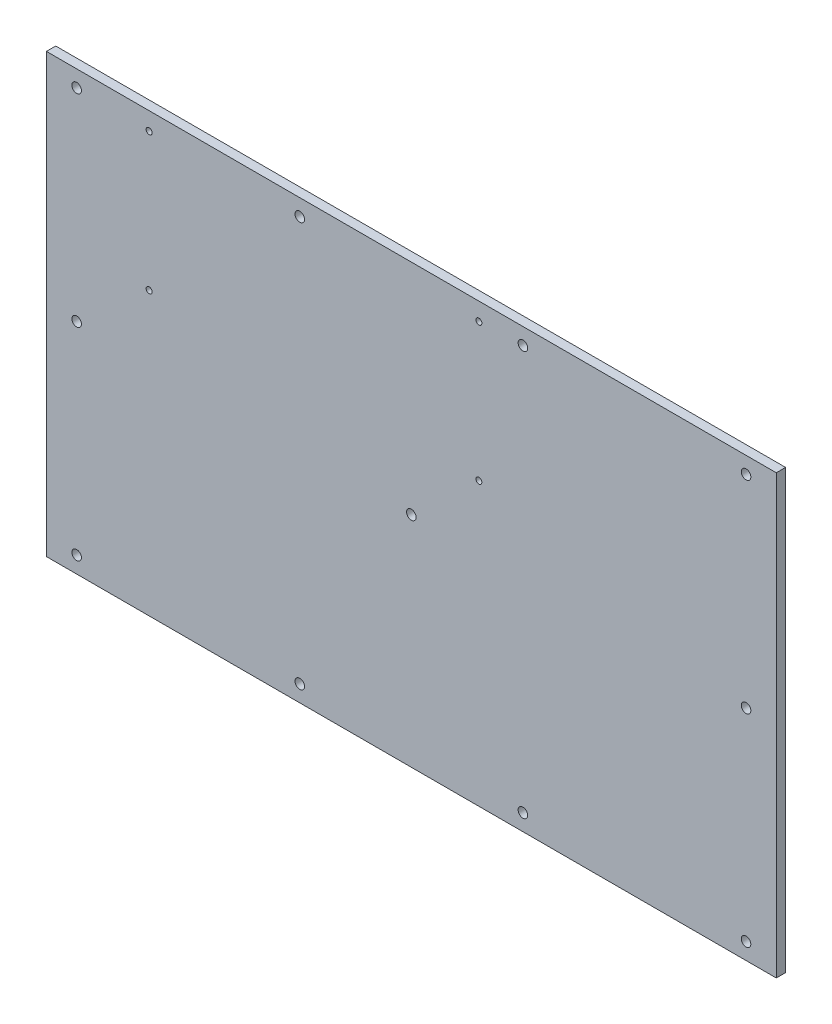
ISO-10303-21;
HEADER;
FILE_DESCRIPTION(('STEP AP214'),'2;1');
FILE_NAME('part.step','',(''),(''),'','','');
FILE_SCHEMA(('AUTOMOTIVE_DESIGN { 1 0 10303 214 1 1 1 1 }'));
ENDSEC;
DATA;
#1=APPLICATION_CONTEXT('core data for automotive mechanical design processes');
#2=APPLICATION_PROTOCOL_DEFINITION('international standard','automotive_design',2000,#1);
#3=PRODUCT_CONTEXT('',#1,'mechanical');
#4=PRODUCT('Part','Part','',(#3));
#5=PRODUCT_RELATED_PRODUCT_CATEGORY('part','',(#4));
#6=PRODUCT_DEFINITION_FORMATION('','',#4);
#7=PRODUCT_DEFINITION_CONTEXT('part definition',#1,'design');
#8=PRODUCT_DEFINITION('design','',#6,#7);
#9=PRODUCT_DEFINITION_SHAPE('','',#8);
#10=(LENGTH_UNIT() NAMED_UNIT(*) SI_UNIT(.MILLI.,.METRE.));
#11=(NAMED_UNIT(*) PLANE_ANGLE_UNIT() SI_UNIT($,.RADIAN.));
#12=(NAMED_UNIT(*) SI_UNIT($,.STERADIAN.) SOLID_ANGLE_UNIT());
#13=UNCERTAINTY_MEASURE_WITH_UNIT(LENGTH_MEASURE(1.E-05),#10,'distance_accuracy_value','');
#14=(GEOMETRIC_REPRESENTATION_CONTEXT(3) GLOBAL_UNCERTAINTY_ASSIGNED_CONTEXT((#13)) GLOBAL_UNIT_ASSIGNED_CONTEXT((#10,
#11,#12)) REPRESENTATION_CONTEXT('',''));
#15=CARTESIAN_POINT('',(0.,0.,0.));
#16=DIRECTION('',(0.,0.,1.));
#17=DIRECTION('',(1.,0.,0.));
#18=AXIS2_PLACEMENT_3D('',#15,#16,#17);
#19=CARTESIAN_POINT('',(-124.46,74.6125,3.175));
#20=DIRECTION('',(1.,0.,0.));
#21=DIRECTION('',(0.,1.,0.));
#22=AXIS2_PLACEMENT_3D('',#19,#20,#21);
#23=PLANE('',#22);
#24=DIRECTION('',(0.,-1.,0.));
#25=VECTOR('',#24,1.);
#26=CARTESIAN_POINT('',(-124.46,74.6125,0.));
#27=LINE('',#26,#25);
#28=CARTESIAN_POINT('',(-124.46,74.6125,0.));
#29=VERTEX_POINT('',#28);
#30=CARTESIAN_POINT('',(-124.46,-74.6125,0.));
#31=VERTEX_POINT('',#30);
#32=EDGE_CURVE('E97',#29,#31,#27,.T.);
#33=ORIENTED_EDGE('',*,*,#32,.T.);
#34=DIRECTION('',(0.,0.,-1.));
#35=VECTOR('',#34,1.);
#36=CARTESIAN_POINT('',(-124.46,-74.6125,3.175));
#37=LINE('',#36,#35);
#38=CARTESIAN_POINT('',(-124.46,-74.6125,3.175));
#39=VERTEX_POINT('',#38);
#40=EDGE_CURVE('E11',#39,#31,#37,.T.);
#41=ORIENTED_EDGE('',*,*,#40,.F.);
#42=DIRECTION('',(0.,-1.,0.));
#43=VECTOR('',#42,1.);
#44=CARTESIAN_POINT('',(-124.46,74.6125,3.175));
#45=LINE('',#44,#43);
#46=CARTESIAN_POINT('',(-124.46,74.6125,3.175));
#47=VERTEX_POINT('',#46);
#48=EDGE_CURVE('E83',#47,#39,#45,.T.);
#49=ORIENTED_EDGE('',*,*,#48,.F.);
#50=DIRECTION('',(0.,0.,-1.));
#51=VECTOR('',#50,1.);
#52=CARTESIAN_POINT('',(-124.46,74.6125,3.175));
#53=LINE('',#52,#51);
#54=EDGE_CURVE('E50',#47,#29,#53,.T.);
#55=ORIENTED_EDGE('',*,*,#54,.T.);
#56=EDGE_LOOP('',(#33,#41,#49,#55));
#57=FACE_BOUND('',#56,.T.);
#58=ADVANCED_FACE('F34',(#57),#23,.F.);
#59=CARTESIAN_POINT('',(-124.46,-74.6125,3.175));
#60=DIRECTION('',(0.,1.,0.));
#61=DIRECTION('',(0.,0.,1.));
#62=AXIS2_PLACEMENT_3D('',#59,#60,#61);
#63=PLANE('',#62);
#64=DIRECTION('',(1.,0.,0.));
#65=VECTOR('',#64,1.);
#66=CARTESIAN_POINT('',(-124.46,-74.6125,0.));
#67=LINE('',#66,#65);
#68=CARTESIAN_POINT('',(124.46,-74.6125,0.));
#69=VERTEX_POINT('',#68);
#70=EDGE_CURVE('E88',#31,#69,#67,.T.);
#71=ORIENTED_EDGE('',*,*,#70,.T.);
#72=DIRECTION('',(0.,0.,-1.));
#73=VECTOR('',#72,1.);
#74=CARTESIAN_POINT('',(124.46,-74.6125,3.175));
#75=LINE('',#74,#73);
#76=CARTESIAN_POINT('',(124.46,-74.6125,3.175));
#77=VERTEX_POINT('',#76);
#78=EDGE_CURVE('E42',#77,#69,#75,.T.);
#79=ORIENTED_EDGE('',*,*,#78,.F.);
#80=DIRECTION('',(1.,0.,0.));
#81=VECTOR('',#80,1.);
#82=CARTESIAN_POINT('',(-124.46,-74.6125,3.175));
#83=LINE('',#82,#81);
#84=EDGE_CURVE('E75',#39,#77,#83,.T.);
#85=ORIENTED_EDGE('',*,*,#84,.F.);
#86=ORIENTED_EDGE('',*,*,#40,.T.);
#87=EDGE_LOOP('',(#71,#79,#85,#86));
#88=FACE_BOUND('',#87,.T.);
#89=ADVANCED_FACE('F87',(#88),#63,.F.);
#90=CARTESIAN_POINT('',(124.46,74.6125,3.175));
#91=DIRECTION('',(1.,0.,0.));
#92=DIRECTION('',(0.,1.,0.));
#93=AXIS2_PLACEMENT_3D('',#90,#91,#92);
#94=PLANE('',#93);
#95=DIRECTION('',(0.,-1.,0.));
#96=VECTOR('',#95,1.);
#97=CARTESIAN_POINT('',(124.46,74.6125,0.));
#98=LINE('',#97,#96);
#99=CARTESIAN_POINT('',(124.46,74.6125,0.));
#100=VERTEX_POINT('',#99);
#101=EDGE_CURVE('E101',#100,#69,#98,.T.);
#102=ORIENTED_EDGE('',*,*,#101,.F.);
#103=DIRECTION('',(0.,0.,-1.));
#104=VECTOR('',#103,1.);
#105=CARTESIAN_POINT('',(124.46,74.6125,3.175));
#106=LINE('',#105,#104);
#107=CARTESIAN_POINT('',(124.46,74.6125,3.175));
#108=VERTEX_POINT('',#107);
#109=EDGE_CURVE('E64',#108,#100,#106,.T.);
#110=ORIENTED_EDGE('',*,*,#109,.F.);
#111=DIRECTION('',(0.,-1.,0.));
#112=VECTOR('',#111,1.);
#113=CARTESIAN_POINT('',(124.46,74.6125,3.175));
#114=LINE('',#113,#112);
#115=EDGE_CURVE('E82',#108,#77,#114,.T.);
#116=ORIENTED_EDGE('',*,*,#115,.T.);
#117=ORIENTED_EDGE('',*,*,#78,.T.);
#118=EDGE_LOOP('',(#102,#110,#116,#117));
#119=FACE_BOUND('',#118,.T.);
#120=ADVANCED_FACE('F91',(#119),#94,.T.);
#121=CARTESIAN_POINT('',(-124.46,74.6125,3.175));
#122=DIRECTION('',(0.,1.,0.));
#123=DIRECTION('',(0.,0.,1.));
#124=AXIS2_PLACEMENT_3D('',#121,#122,#123);
#125=PLANE('',#124);
#126=DIRECTION('',(1.,0.,0.));
#127=VECTOR('',#126,1.);
#128=CARTESIAN_POINT('',(-124.46,74.6125,0.));
#129=LINE('',#128,#127);
#130=EDGE_CURVE('E103',#29,#100,#129,.T.);
#131=ORIENTED_EDGE('',*,*,#130,.F.);
#132=ORIENTED_EDGE('',*,*,#54,.F.);
#133=DIRECTION('',(1.,0.,0.));
#134=VECTOR('',#133,1.);
#135=CARTESIAN_POINT('',(-124.46,74.6125,3.175));
#136=LINE('',#135,#134);
#137=EDGE_CURVE('E92',#47,#108,#136,.T.);
#138=ORIENTED_EDGE('',*,*,#137,.T.);
#139=ORIENTED_EDGE('',*,*,#109,.T.);
#140=EDGE_LOOP('',(#131,#132,#138,#139));
#141=FACE_BOUND('',#140,.T.);
#142=ADVANCED_FACE('F233',(#141),#125,.T.);
#143=CARTESIAN_POINT('',(0.,0.,3.175));
#144=DIRECTION('',(0.,0.,1.));
#145=DIRECTION('',(1.,0.,0.));
#146=AXIS2_PLACEMENT_3D('',#143,#144,#145);
#147=PLANE('',#146);
#148=CARTESIAN_POINT('',(23.0377999999999,21.5773,3.175));
#149=DIRECTION('',(0.,0.,1.));
#150=DIRECTION('',(1.,0.,0.));
#151=AXIS2_PLACEMENT_3D('',#148,#149,#150);
#152=CIRCLE('',#151,1.016);
#153=CARTESIAN_POINT('',(24.0537999999999,21.5773,3.175));
#154=VERTEX_POINT('',#153);
#155=EDGE_CURVE('E192',#154,#154,#152,.T.);
#156=ORIENTED_EDGE('',*,*,#155,.F.);
#157=EDGE_LOOP('',(#156));
#158=FACE_BOUND('',#157,.T.);
#159=CARTESIAN_POINT('',(23.0377999999999,68.5673,3.175));
#160=DIRECTION('',(0.,0.,1.));
#161=DIRECTION('',(1.,0.,0.));
#162=AXIS2_PLACEMENT_3D('',#159,#160,#161);
#163=CIRCLE('',#162,1.016);
#164=CARTESIAN_POINT('',(24.0537999999999,68.5673,3.175));
#165=VERTEX_POINT('',#164);
#166=EDGE_CURVE('E186',#165,#165,#163,.T.);
#167=ORIENTED_EDGE('',*,*,#166,.F.);
#168=EDGE_LOOP('',(#167));
#169=FACE_BOUND('',#168,.T.);
#170=CARTESIAN_POINT('',(-89.4334,68.5673,3.175));
#171=DIRECTION('',(0.,0.,1.));
#172=DIRECTION('',(1.,0.,0.));
#173=AXIS2_PLACEMENT_3D('',#170,#171,#172);
#174=CIRCLE('',#173,1.016);
#175=CARTESIAN_POINT('',(-88.4174,68.5673,3.175));
#176=VERTEX_POINT('',#175);
#177=EDGE_CURVE('E180',#176,#176,#174,.T.);
#178=ORIENTED_EDGE('',*,*,#177,.F.);
#179=EDGE_LOOP('',(#178));
#180=FACE_BOUND('',#179,.T.);
#181=CARTESIAN_POINT('',(-89.4334,21.5773,3.175));
#182=DIRECTION('',(0.,0.,1.));
#183=DIRECTION('',(1.,0.,0.));
#184=AXIS2_PLACEMENT_3D('',#181,#182,#183);
#185=CIRCLE('',#184,1.016);
#186=CARTESIAN_POINT('',(-88.4174,21.5773,3.175));
#187=VERTEX_POINT('',#186);
#188=EDGE_CURVE('E174',#187,#187,#185,.T.);
#189=ORIENTED_EDGE('',*,*,#188,.F.);
#190=EDGE_LOOP('',(#189));
#191=FACE_BOUND('',#190,.T.);
#192=CARTESIAN_POINT('',(-114.1476,-68.9864,3.175));
#193=DIRECTION('',(0.,0.,1.));
#194=DIRECTION('',(1.,0.,0.));
#195=AXIS2_PLACEMENT_3D('',#192,#193,#194);
#196=CIRCLE('',#195,1.63194999999999);
#197=CARTESIAN_POINT('',(-112.51565,-68.9864,3.175));
#198=VERTEX_POINT('',#197);
#199=EDGE_CURVE('E168',#198,#198,#196,.T.);
#200=ORIENTED_EDGE('',*,*,#199,.F.);
#201=EDGE_LOOP('',(#200));
#202=FACE_BOUND('',#201,.T.);
#203=CARTESIAN_POINT('',(114.1476,-68.9864,3.175));
#204=DIRECTION('',(0.,0.,1.));
#205=DIRECTION('',(1.,0.,0.));
#206=AXIS2_PLACEMENT_3D('',#203,#204,#205);
#207=CIRCLE('',#206,1.63194999999999);
#208=CARTESIAN_POINT('',(115.77955,-68.9864,3.175));
#209=VERTEX_POINT('',#208);
#210=EDGE_CURVE('E162',#209,#209,#207,.T.);
#211=ORIENTED_EDGE('',*,*,#210,.F.);
#212=EDGE_LOOP('',(#211));
#213=FACE_BOUND('',#212,.T.);
#214=CARTESIAN_POINT('',(114.1476,68.9864,3.175));
#215=DIRECTION('',(0.,0.,1.));
#216=DIRECTION('',(1.,0.,0.));
#217=AXIS2_PLACEMENT_3D('',#214,#215,#216);
#218=CIRCLE('',#217,1.63194999999999);
#219=CARTESIAN_POINT('',(115.77955,68.9864,3.175));
#220=VERTEX_POINT('',#219);
#221=EDGE_CURVE('E156',#220,#220,#218,.T.);
#222=ORIENTED_EDGE('',*,*,#221,.F.);
#223=EDGE_LOOP('',(#222));
#224=FACE_BOUND('',#223,.T.);
#225=CARTESIAN_POINT('',(-114.1476,68.9864,3.175));
#226=DIRECTION('',(0.,0.,1.));
#227=DIRECTION('',(1.,0.,0.));
#228=AXIS2_PLACEMENT_3D('',#225,#226,#227);
#229=CIRCLE('',#228,1.63194999999999);
#230=CARTESIAN_POINT('',(-112.51565,68.9864,3.175));
#231=VERTEX_POINT('',#230);
#232=EDGE_CURVE('E150',#231,#231,#229,.T.);
#233=ORIENTED_EDGE('',*,*,#232,.F.);
#234=EDGE_LOOP('',(#233));
#235=FACE_BOUND('',#234,.T.);
#236=CARTESIAN_POINT('',(-114.1476,0.,3.175));
#237=DIRECTION('',(0.,0.,1.));
#238=DIRECTION('',(1.,0.,0.));
#239=AXIS2_PLACEMENT_3D('',#236,#237,#238);
#240=CIRCLE('',#239,1.63194999999999);
#241=CARTESIAN_POINT('',(-112.51565,0.,3.175));
#242=VERTEX_POINT('',#241);
#243=EDGE_CURVE('E144',#242,#242,#240,.T.);
#244=ORIENTED_EDGE('',*,*,#243,.F.);
#245=EDGE_LOOP('',(#244));
#246=FACE_BOUND('',#245,.T.);
#247=CARTESIAN_POINT('',(114.1476,0.,3.175));
#248=DIRECTION('',(0.,0.,1.));
#249=DIRECTION('',(1.,0.,0.));
#250=AXIS2_PLACEMENT_3D('',#247,#248,#249);
#251=CIRCLE('',#250,1.63194999999999);
#252=CARTESIAN_POINT('',(115.77955,0.,3.175));
#253=VERTEX_POINT('',#252);
#254=EDGE_CURVE('E138',#253,#253,#251,.T.);
#255=ORIENTED_EDGE('',*,*,#254,.F.);
#256=EDGE_LOOP('',(#255));
#257=FACE_BOUND('',#256,.T.);
#258=CARTESIAN_POINT('',(-38.0492,68.9864,3.175));
#259=DIRECTION('',(0.,0.,1.));
#260=DIRECTION('',(1.,0.,0.));
#261=AXIS2_PLACEMENT_3D('',#258,#259,#260);
#262=CIRCLE('',#261,1.63194999999999);
#263=CARTESIAN_POINT('',(-36.41725,68.9864,3.175));
#264=VERTEX_POINT('',#263);
#265=EDGE_CURVE('E132',#264,#264,#262,.T.);
#266=ORIENTED_EDGE('',*,*,#265,.F.);
#267=EDGE_LOOP('',(#266));
#268=FACE_BOUND('',#267,.T.);
#269=CARTESIAN_POINT('',(38.0492,68.9864,3.175));
#270=DIRECTION('',(0.,0.,1.));
#271=DIRECTION('',(1.,0.,0.));
#272=AXIS2_PLACEMENT_3D('',#269,#270,#271);
#273=CIRCLE('',#272,1.63194999999999);
#274=CARTESIAN_POINT('',(39.68115,68.9864,3.175));
#275=VERTEX_POINT('',#274);
#276=EDGE_CURVE('E126',#275,#275,#273,.T.);
#277=ORIENTED_EDGE('',*,*,#276,.F.);
#278=EDGE_LOOP('',(#277));
#279=FACE_BOUND('',#278,.T.);
#280=CARTESIAN_POINT('',(38.0492,-68.9864,3.175));
#281=DIRECTION('',(0.,0.,1.));
#282=DIRECTION('',(1.,0.,0.));
#283=AXIS2_PLACEMENT_3D('',#280,#281,#282);
#284=CIRCLE('',#283,1.63194999999999);
#285=CARTESIAN_POINT('',(39.68115,-68.9864,3.175));
#286=VERTEX_POINT('',#285);
#287=EDGE_CURVE('E120',#286,#286,#284,.T.);
#288=ORIENTED_EDGE('',*,*,#287,.F.);
#289=EDGE_LOOP('',(#288));
#290=FACE_BOUND('',#289,.T.);
#291=CARTESIAN_POINT('',(-38.0492,-68.9864,3.175));
#292=DIRECTION('',(0.,0.,1.));
#293=DIRECTION('',(1.,0.,0.));
#294=AXIS2_PLACEMENT_3D('',#291,#292,#293);
#295=CIRCLE('',#294,1.63194999999999);
#296=CARTESIAN_POINT('',(-36.41725,-68.9864,3.175));
#297=VERTEX_POINT('',#296);
#298=EDGE_CURVE('E114',#297,#297,#295,.T.);
#299=ORIENTED_EDGE('',*,*,#298,.F.);
#300=EDGE_LOOP('',(#299));
#301=FACE_BOUND('',#300,.T.);
#302=CARTESIAN_POINT('',(0.,0.,3.175));
#303=DIRECTION('',(0.,0.,1.));
#304=DIRECTION('',(1.,0.,0.));
#305=AXIS2_PLACEMENT_3D('',#302,#303,#304);
#306=CIRCLE('',#305,1.63194999999999);
#307=CARTESIAN_POINT('',(1.63194999999999,0.,3.175));
#308=VERTEX_POINT('',#307);
#309=EDGE_CURVE('E99',#308,#308,#306,.T.);
#310=ORIENTED_EDGE('',*,*,#309,.F.);
#311=EDGE_LOOP('',(#310));
#312=FACE_BOUND('',#311,.T.);
#313=ORIENTED_EDGE('',*,*,#48,.T.);
#314=ORIENTED_EDGE('',*,*,#84,.T.);
#315=ORIENTED_EDGE('',*,*,#115,.F.);
#316=ORIENTED_EDGE('',*,*,#137,.F.);
#317=EDGE_LOOP('',(#313,#314,#315,#316));
#318=FACE_BOUND('',#317,.T.);
#319=ADVANCED_FACE('F79',(#158,#169,#180,#191,#202,#213,#224,#235,#246,#257,#268,#279,#290,#301,
#312,#318),#147,.T.);
#320=CARTESIAN_POINT('',(0.,0.,0.));
#321=DIRECTION('',(0.,0.,1.));
#322=DIRECTION('',(1.,0.,0.));
#323=AXIS2_PLACEMENT_3D('',#320,#321,#322);
#324=PLANE('',#323);
#325=CARTESIAN_POINT('',(23.0377999999999,21.5773,0.));
#326=DIRECTION('',(0.,0.,-1.));
#327=DIRECTION('',(-1.,0.,0.));
#328=AXIS2_PLACEMENT_3D('',#325,#326,#327);
#329=CIRCLE('',#328,1.016);
#330=CARTESIAN_POINT('',(22.0217999999999,21.5773,0.));
#331=VERTEX_POINT('',#330);
#332=EDGE_CURVE('E195',#331,#331,#329,.T.);
#333=ORIENTED_EDGE('',*,*,#332,.F.);
#334=EDGE_LOOP('',(#333));
#335=FACE_BOUND('',#334,.T.);
#336=CARTESIAN_POINT('',(23.0377999999999,68.5673,0.));
#337=DIRECTION('',(0.,0.,-1.));
#338=DIRECTION('',(-1.,0.,0.));
#339=AXIS2_PLACEMENT_3D('',#336,#337,#338);
#340=CIRCLE('',#339,1.016);
#341=CARTESIAN_POINT('',(22.0217999999999,68.5673,0.));
#342=VERTEX_POINT('',#341);
#343=EDGE_CURVE('E189',#342,#342,#340,.T.);
#344=ORIENTED_EDGE('',*,*,#343,.F.);
#345=EDGE_LOOP('',(#344));
#346=FACE_BOUND('',#345,.T.);
#347=CARTESIAN_POINT('',(-89.4334,68.5673,0.));
#348=DIRECTION('',(0.,0.,-1.));
#349=DIRECTION('',(-1.,0.,0.));
#350=AXIS2_PLACEMENT_3D('',#347,#348,#349);
#351=CIRCLE('',#350,1.016);
#352=CARTESIAN_POINT('',(-90.4494,68.5673,0.));
#353=VERTEX_POINT('',#352);
#354=EDGE_CURVE('E183',#353,#353,#351,.T.);
#355=ORIENTED_EDGE('',*,*,#354,.F.);
#356=EDGE_LOOP('',(#355));
#357=FACE_BOUND('',#356,.T.);
#358=CARTESIAN_POINT('',(-89.4334,21.5773,0.));
#359=DIRECTION('',(0.,0.,-1.));
#360=DIRECTION('',(-1.,0.,0.));
#361=AXIS2_PLACEMENT_3D('',#358,#359,#360);
#362=CIRCLE('',#361,1.016);
#363=CARTESIAN_POINT('',(-90.4494,21.5773,0.));
#364=VERTEX_POINT('',#363);
#365=EDGE_CURVE('E177',#364,#364,#362,.T.);
#366=ORIENTED_EDGE('',*,*,#365,.F.);
#367=EDGE_LOOP('',(#366));
#368=FACE_BOUND('',#367,.T.);
#369=CARTESIAN_POINT('',(-114.1476,-68.9864,0.));
#370=DIRECTION('',(0.,0.,-1.));
#371=DIRECTION('',(-1.,0.,0.));
#372=AXIS2_PLACEMENT_3D('',#369,#370,#371);
#373=CIRCLE('',#372,1.63194999999999);
#374=CARTESIAN_POINT('',(-115.77955,-68.9864,0.));
#375=VERTEX_POINT('',#374);
#376=EDGE_CURVE('E171',#375,#375,#373,.T.);
#377=ORIENTED_EDGE('',*,*,#376,.F.);
#378=EDGE_LOOP('',(#377));
#379=FACE_BOUND('',#378,.T.);
#380=CARTESIAN_POINT('',(114.1476,-68.9864,0.));
#381=DIRECTION('',(0.,0.,-1.));
#382=DIRECTION('',(-1.,0.,0.));
#383=AXIS2_PLACEMENT_3D('',#380,#381,#382);
#384=CIRCLE('',#383,1.63194999999999);
#385=CARTESIAN_POINT('',(112.51565,-68.9864,0.));
#386=VERTEX_POINT('',#385);
#387=EDGE_CURVE('E165',#386,#386,#384,.T.);
#388=ORIENTED_EDGE('',*,*,#387,.F.);
#389=EDGE_LOOP('',(#388));
#390=FACE_BOUND('',#389,.T.);
#391=CARTESIAN_POINT('',(114.1476,68.9864,0.));
#392=DIRECTION('',(0.,0.,-1.));
#393=DIRECTION('',(-1.,0.,0.));
#394=AXIS2_PLACEMENT_3D('',#391,#392,#393);
#395=CIRCLE('',#394,1.63194999999999);
#396=CARTESIAN_POINT('',(112.51565,68.9864,0.));
#397=VERTEX_POINT('',#396);
#398=EDGE_CURVE('E159',#397,#397,#395,.T.);
#399=ORIENTED_EDGE('',*,*,#398,.F.);
#400=EDGE_LOOP('',(#399));
#401=FACE_BOUND('',#400,.T.);
#402=CARTESIAN_POINT('',(-114.1476,68.9864,0.));
#403=DIRECTION('',(0.,0.,-1.));
#404=DIRECTION('',(-1.,0.,0.));
#405=AXIS2_PLACEMENT_3D('',#402,#403,#404);
#406=CIRCLE('',#405,1.63194999999999);
#407=CARTESIAN_POINT('',(-115.77955,68.9864,0.));
#408=VERTEX_POINT('',#407);
#409=EDGE_CURVE('E153',#408,#408,#406,.T.);
#410=ORIENTED_EDGE('',*,*,#409,.F.);
#411=EDGE_LOOP('',(#410));
#412=FACE_BOUND('',#411,.T.);
#413=CARTESIAN_POINT('',(-114.1476,0.,0.));
#414=DIRECTION('',(0.,0.,-1.));
#415=DIRECTION('',(-1.,0.,0.));
#416=AXIS2_PLACEMENT_3D('',#413,#414,#415);
#417=CIRCLE('',#416,1.63194999999999);
#418=CARTESIAN_POINT('',(-115.77955,0.,0.));
#419=VERTEX_POINT('',#418);
#420=EDGE_CURVE('E147',#419,#419,#417,.T.);
#421=ORIENTED_EDGE('',*,*,#420,.F.);
#422=EDGE_LOOP('',(#421));
#423=FACE_BOUND('',#422,.T.);
#424=CARTESIAN_POINT('',(114.1476,0.,0.));
#425=DIRECTION('',(0.,0.,-1.));
#426=DIRECTION('',(-1.,0.,0.));
#427=AXIS2_PLACEMENT_3D('',#424,#425,#426);
#428=CIRCLE('',#427,1.63194999999999);
#429=CARTESIAN_POINT('',(112.51565,0.,0.));
#430=VERTEX_POINT('',#429);
#431=EDGE_CURVE('E141',#430,#430,#428,.T.);
#432=ORIENTED_EDGE('',*,*,#431,.F.);
#433=EDGE_LOOP('',(#432));
#434=FACE_BOUND('',#433,.T.);
#435=CARTESIAN_POINT('',(-38.0492,68.9864,0.));
#436=DIRECTION('',(0.,0.,-1.));
#437=DIRECTION('',(-1.,0.,0.));
#438=AXIS2_PLACEMENT_3D('',#435,#436,#437);
#439=CIRCLE('',#438,1.63194999999999);
#440=CARTESIAN_POINT('',(-39.68115,68.9864,0.));
#441=VERTEX_POINT('',#440);
#442=EDGE_CURVE('E135',#441,#441,#439,.T.);
#443=ORIENTED_EDGE('',*,*,#442,.F.);
#444=EDGE_LOOP('',(#443));
#445=FACE_BOUND('',#444,.T.);
#446=CARTESIAN_POINT('',(38.0492,68.9864,0.));
#447=DIRECTION('',(0.,0.,-1.));
#448=DIRECTION('',(-1.,0.,0.));
#449=AXIS2_PLACEMENT_3D('',#446,#447,#448);
#450=CIRCLE('',#449,1.63194999999999);
#451=CARTESIAN_POINT('',(36.41725,68.9864,0.));
#452=VERTEX_POINT('',#451);
#453=EDGE_CURVE('E129',#452,#452,#450,.T.);
#454=ORIENTED_EDGE('',*,*,#453,.F.);
#455=EDGE_LOOP('',(#454));
#456=FACE_BOUND('',#455,.T.);
#457=CARTESIAN_POINT('',(38.0492,-68.9864,0.));
#458=DIRECTION('',(0.,0.,-1.));
#459=DIRECTION('',(-1.,0.,0.));
#460=AXIS2_PLACEMENT_3D('',#457,#458,#459);
#461=CIRCLE('',#460,1.63194999999999);
#462=CARTESIAN_POINT('',(36.41725,-68.9864,0.));
#463=VERTEX_POINT('',#462);
#464=EDGE_CURVE('E123',#463,#463,#461,.T.);
#465=ORIENTED_EDGE('',*,*,#464,.F.);
#466=EDGE_LOOP('',(#465));
#467=FACE_BOUND('',#466,.T.);
#468=CARTESIAN_POINT('',(-38.0492,-68.9864,0.));
#469=DIRECTION('',(0.,0.,-1.));
#470=DIRECTION('',(-1.,0.,0.));
#471=AXIS2_PLACEMENT_3D('',#468,#469,#470);
#472=CIRCLE('',#471,1.63194999999999);
#473=CARTESIAN_POINT('',(-39.68115,-68.9864,0.));
#474=VERTEX_POINT('',#473);
#475=EDGE_CURVE('E117',#474,#474,#472,.T.);
#476=ORIENTED_EDGE('',*,*,#475,.F.);
#477=EDGE_LOOP('',(#476));
#478=FACE_BOUND('',#477,.T.);
#479=CARTESIAN_POINT('',(0.,0.,0.));
#480=DIRECTION('',(0.,0.,-1.));
#481=DIRECTION('',(-1.,0.,0.));
#482=AXIS2_PLACEMENT_3D('',#479,#480,#481);
#483=CIRCLE('',#482,1.63194999999999);
#484=CARTESIAN_POINT('',(-1.63194999999999,0.,0.));
#485=VERTEX_POINT('',#484);
#486=EDGE_CURVE('E111',#485,#485,#483,.T.);
#487=ORIENTED_EDGE('',*,*,#486,.F.);
#488=EDGE_LOOP('',(#487));
#489=FACE_BOUND('',#488,.T.);
#490=ORIENTED_EDGE('',*,*,#32,.F.);
#491=ORIENTED_EDGE('',*,*,#130,.T.);
#492=ORIENTED_EDGE('',*,*,#101,.T.);
#493=ORIENTED_EDGE('',*,*,#70,.F.);
#494=EDGE_LOOP('',(#490,#491,#492,#493));
#495=FACE_BOUND('',#494,.T.);
#496=ADVANCED_FACE('F201',(#335,#346,#357,#368,#379,#390,#401,#412,#423,#434,#445,#456,#467,
#478,#489,#495),#324,.F.);
#497=CARTESIAN_POINT('',(0.,0.,0.));
#498=DIRECTION('',(0.,0.,-1.));
#499=DIRECTION('',(-1.,0.,0.));
#500=AXIS2_PLACEMENT_3D('',#497,#498,#499);
#501=CYLINDRICAL_SURFACE('',#500,1.63194999999999);
#502=ORIENTED_EDGE('',*,*,#309,.T.);
#503=EDGE_LOOP('',(#502));
#504=FACE_BOUND('',#503,.T.);
#505=ORIENTED_EDGE('',*,*,#486,.T.);
#506=EDGE_LOOP('',(#505));
#507=FACE_BOUND('',#506,.T.);
#508=ADVANCED_FACE('F204',(#504,#507),#501,.F.);
#509=CARTESIAN_POINT('',(-38.0492,-68.9864,0.));
#510=DIRECTION('',(0.,0.,-1.));
#511=DIRECTION('',(-1.,0.,0.));
#512=AXIS2_PLACEMENT_3D('',#509,#510,#511);
#513=CYLINDRICAL_SURFACE('',#512,1.63194999999999);
#514=ORIENTED_EDGE('',*,*,#298,.T.);
#515=EDGE_LOOP('',(#514));
#516=FACE_BOUND('',#515,.T.);
#517=ORIENTED_EDGE('',*,*,#475,.T.);
#518=EDGE_LOOP('',(#517));
#519=FACE_BOUND('',#518,.T.);
#520=ADVANCED_FACE('F267',(#516,#519),#513,.F.);
#521=CARTESIAN_POINT('',(38.0492,-68.9864,0.));
#522=DIRECTION('',(0.,0.,-1.));
#523=DIRECTION('',(-1.,0.,0.));
#524=AXIS2_PLACEMENT_3D('',#521,#522,#523);
#525=CYLINDRICAL_SURFACE('',#524,1.63194999999999);
#526=ORIENTED_EDGE('',*,*,#287,.T.);
#527=EDGE_LOOP('',(#526));
#528=FACE_BOUND('',#527,.T.);
#529=ORIENTED_EDGE('',*,*,#464,.T.);
#530=EDGE_LOOP('',(#529));
#531=FACE_BOUND('',#530,.T.);
#532=ADVANCED_FACE('F278',(#528,#531),#525,.F.);
#533=CARTESIAN_POINT('',(38.0492,68.9864,0.));
#534=DIRECTION('',(0.,0.,-1.));
#535=DIRECTION('',(-1.,0.,0.));
#536=AXIS2_PLACEMENT_3D('',#533,#534,#535);
#537=CYLINDRICAL_SURFACE('',#536,1.63194999999999);
#538=ORIENTED_EDGE('',*,*,#276,.T.);
#539=EDGE_LOOP('',(#538));
#540=FACE_BOUND('',#539,.T.);
#541=ORIENTED_EDGE('',*,*,#453,.T.);
#542=EDGE_LOOP('',(#541));
#543=FACE_BOUND('',#542,.T.);
#544=ADVANCED_FACE('F288',(#540,#543),#537,.F.);
#545=CARTESIAN_POINT('',(-38.0492,68.9864,0.));
#546=DIRECTION('',(0.,0.,-1.));
#547=DIRECTION('',(-1.,0.,0.));
#548=AXIS2_PLACEMENT_3D('',#545,#546,#547);
#549=CYLINDRICAL_SURFACE('',#548,1.63194999999999);
#550=ORIENTED_EDGE('',*,*,#265,.T.);
#551=EDGE_LOOP('',(#550));
#552=FACE_BOUND('',#551,.T.);
#553=ORIENTED_EDGE('',*,*,#442,.T.);
#554=EDGE_LOOP('',(#553));
#555=FACE_BOUND('',#554,.T.);
#556=ADVANCED_FACE('F298',(#552,#555),#549,.F.);
#557=CARTESIAN_POINT('',(114.1476,0.,0.));
#558=DIRECTION('',(0.,0.,-1.));
#559=DIRECTION('',(-1.,0.,0.));
#560=AXIS2_PLACEMENT_3D('',#557,#558,#559);
#561=CYLINDRICAL_SURFACE('',#560,1.63194999999999);
#562=ORIENTED_EDGE('',*,*,#254,.T.);
#563=EDGE_LOOP('',(#562));
#564=FACE_BOUND('',#563,.T.);
#565=ORIENTED_EDGE('',*,*,#431,.T.);
#566=EDGE_LOOP('',(#565));
#567=FACE_BOUND('',#566,.T.);
#568=ADVANCED_FACE('F308',(#564,#567),#561,.F.);
#569=CARTESIAN_POINT('',(-114.1476,0.,0.));
#570=DIRECTION('',(0.,0.,-1.));
#571=DIRECTION('',(-1.,0.,0.));
#572=AXIS2_PLACEMENT_3D('',#569,#570,#571);
#573=CYLINDRICAL_SURFACE('',#572,1.63194999999999);
#574=ORIENTED_EDGE('',*,*,#243,.T.);
#575=EDGE_LOOP('',(#574));
#576=FACE_BOUND('',#575,.T.);
#577=ORIENTED_EDGE('',*,*,#420,.T.);
#578=EDGE_LOOP('',(#577));
#579=FACE_BOUND('',#578,.T.);
#580=ADVANCED_FACE('F318',(#576,#579),#573,.F.);
#581=CARTESIAN_POINT('',(-114.1476,68.9864,0.));
#582=DIRECTION('',(0.,0.,-1.));
#583=DIRECTION('',(-1.,0.,0.));
#584=AXIS2_PLACEMENT_3D('',#581,#582,#583);
#585=CYLINDRICAL_SURFACE('',#584,1.63194999999999);
#586=ORIENTED_EDGE('',*,*,#232,.T.);
#587=EDGE_LOOP('',(#586));
#588=FACE_BOUND('',#587,.T.);
#589=ORIENTED_EDGE('',*,*,#409,.T.);
#590=EDGE_LOOP('',(#589));
#591=FACE_BOUND('',#590,.T.);
#592=ADVANCED_FACE('F328',(#588,#591),#585,.F.);
#593=CARTESIAN_POINT('',(114.1476,68.9864,0.));
#594=DIRECTION('',(0.,0.,-1.));
#595=DIRECTION('',(-1.,0.,0.));
#596=AXIS2_PLACEMENT_3D('',#593,#594,#595);
#597=CYLINDRICAL_SURFACE('',#596,1.63194999999999);
#598=ORIENTED_EDGE('',*,*,#221,.T.);
#599=EDGE_LOOP('',(#598));
#600=FACE_BOUND('',#599,.T.);
#601=ORIENTED_EDGE('',*,*,#398,.T.);
#602=EDGE_LOOP('',(#601));
#603=FACE_BOUND('',#602,.T.);
#604=ADVANCED_FACE('F338',(#600,#603),#597,.F.);
#605=CARTESIAN_POINT('',(114.1476,-68.9864,0.));
#606=DIRECTION('',(0.,0.,-1.));
#607=DIRECTION('',(-1.,0.,0.));
#608=AXIS2_PLACEMENT_3D('',#605,#606,#607);
#609=CYLINDRICAL_SURFACE('',#608,1.63194999999999);
#610=ORIENTED_EDGE('',*,*,#210,.T.);
#611=EDGE_LOOP('',(#610));
#612=FACE_BOUND('',#611,.T.);
#613=ORIENTED_EDGE('',*,*,#387,.T.);
#614=EDGE_LOOP('',(#613));
#615=FACE_BOUND('',#614,.T.);
#616=ADVANCED_FACE('F348',(#612,#615),#609,.F.);
#617=CARTESIAN_POINT('',(-114.1476,-68.9864,0.));
#618=DIRECTION('',(0.,0.,-1.));
#619=DIRECTION('',(-1.,0.,0.));
#620=AXIS2_PLACEMENT_3D('',#617,#618,#619);
#621=CYLINDRICAL_SURFACE('',#620,1.63194999999999);
#622=ORIENTED_EDGE('',*,*,#199,.T.);
#623=EDGE_LOOP('',(#622));
#624=FACE_BOUND('',#623,.T.);
#625=ORIENTED_EDGE('',*,*,#376,.T.);
#626=EDGE_LOOP('',(#625));
#627=FACE_BOUND('',#626,.T.);
#628=ADVANCED_FACE('F358',(#624,#627),#621,.F.);
#629=CARTESIAN_POINT('',(-89.4334,21.5773,0.));
#630=DIRECTION('',(0.,0.,-1.));
#631=DIRECTION('',(-1.,0.,0.));
#632=AXIS2_PLACEMENT_3D('',#629,#630,#631);
#633=CYLINDRICAL_SURFACE('',#632,1.016);
#634=ORIENTED_EDGE('',*,*,#188,.T.);
#635=EDGE_LOOP('',(#634));
#636=FACE_BOUND('',#635,.T.);
#637=ORIENTED_EDGE('',*,*,#365,.T.);
#638=EDGE_LOOP('',(#637));
#639=FACE_BOUND('',#638,.T.);
#640=ADVANCED_FACE('F368',(#636,#639),#633,.F.);
#641=CARTESIAN_POINT('',(-89.4334,68.5673,0.));
#642=DIRECTION('',(0.,0.,-1.));
#643=DIRECTION('',(-1.,0.,0.));
#644=AXIS2_PLACEMENT_3D('',#641,#642,#643);
#645=CYLINDRICAL_SURFACE('',#644,1.016);
#646=ORIENTED_EDGE('',*,*,#177,.T.);
#647=EDGE_LOOP('',(#646));
#648=FACE_BOUND('',#647,.T.);
#649=ORIENTED_EDGE('',*,*,#354,.T.);
#650=EDGE_LOOP('',(#649));
#651=FACE_BOUND('',#650,.T.);
#652=ADVANCED_FACE('F389',(#648,#651),#645,.F.);
#653=CARTESIAN_POINT('',(23.0377999999999,68.5673,0.));
#654=DIRECTION('',(0.,0.,-1.));
#655=DIRECTION('',(-1.,0.,0.));
#656=AXIS2_PLACEMENT_3D('',#653,#654,#655);
#657=CYLINDRICAL_SURFACE('',#656,1.016);
#658=ORIENTED_EDGE('',*,*,#166,.T.);
#659=EDGE_LOOP('',(#658));
#660=FACE_BOUND('',#659,.T.);
#661=ORIENTED_EDGE('',*,*,#343,.T.);
#662=EDGE_LOOP('',(#661));
#663=FACE_BOUND('',#662,.T.);
#664=ADVANCED_FACE('F400',(#660,#663),#657,.F.);
#665=CARTESIAN_POINT('',(23.0377999999999,21.5773,0.));
#666=DIRECTION('',(0.,0.,-1.));
#667=DIRECTION('',(-1.,0.,0.));
#668=AXIS2_PLACEMENT_3D('',#665,#666,#667);
#669=CYLINDRICAL_SURFACE('',#668,1.016);
#670=ORIENTED_EDGE('',*,*,#155,.T.);
#671=EDGE_LOOP('',(#670));
#672=FACE_BOUND('',#671,.T.);
#673=ORIENTED_EDGE('',*,*,#332,.T.);
#674=EDGE_LOOP('',(#673));
#675=FACE_BOUND('',#674,.T.);
#676=ADVANCED_FACE('F199',(#672,#675),#669,.F.);
#677=CLOSED_SHELL('',(#58,#89,#120,#142,#319,#496,#508,#520,#532,#544,#556,#568,#580,#592,#604,
#616,#628,#640,#652,#664,#676));
#678=MANIFOLD_SOLID_BREP('B2',#677);
#679=ADVANCED_BREP_SHAPE_REPRESENTATION('',(#18,#678),#14);
#680=SHAPE_DEFINITION_REPRESENTATION(#9,#679);
ENDSEC;
END-ISO-10303-21;
